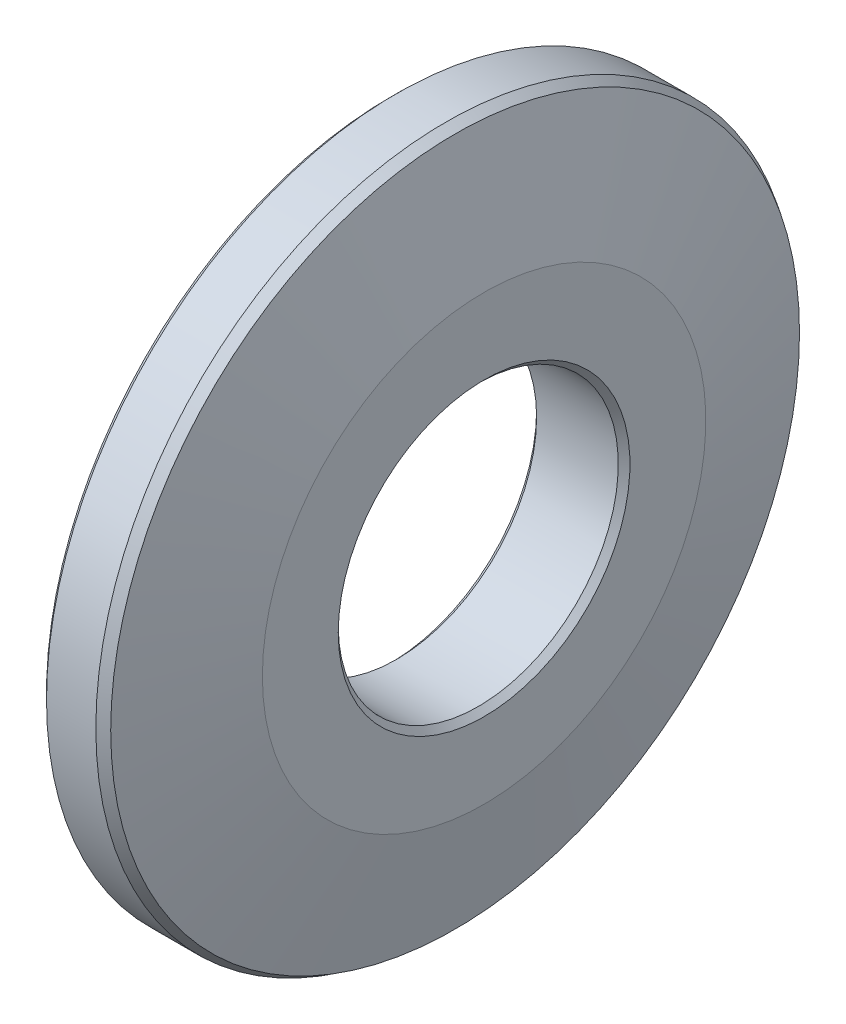
ISO-10303-21;
HEADER;
FILE_DESCRIPTION(('STEP AP214'),'2;1');
FILE_NAME('part.step','',(''),(''),'','','');
FILE_SCHEMA(('AUTOMOTIVE_DESIGN { 1 0 10303 214 1 1 1 1 }'));
ENDSEC;
DATA;
#1=APPLICATION_CONTEXT('core data for automotive mechanical design processes');
#2=APPLICATION_PROTOCOL_DEFINITION('international standard','automotive_design',2000,#1);
#3=PRODUCT_CONTEXT('',#1,'mechanical');
#4=PRODUCT('Part','Part','',(#3));
#5=PRODUCT_RELATED_PRODUCT_CATEGORY('part','',(#4));
#6=PRODUCT_DEFINITION_FORMATION('','',#4);
#7=PRODUCT_DEFINITION_CONTEXT('part definition',#1,'design');
#8=PRODUCT_DEFINITION('design','',#6,#7);
#9=PRODUCT_DEFINITION_SHAPE('','',#8);
#10=(LENGTH_UNIT() NAMED_UNIT(*) SI_UNIT(.MILLI.,.METRE.));
#11=(NAMED_UNIT(*) PLANE_ANGLE_UNIT() SI_UNIT($,.RADIAN.));
#12=(NAMED_UNIT(*) SI_UNIT($,.STERADIAN.) SOLID_ANGLE_UNIT());
#13=UNCERTAINTY_MEASURE_WITH_UNIT(LENGTH_MEASURE(1.E-05),#10,'distance_accuracy_value','');
#14=(GEOMETRIC_REPRESENTATION_CONTEXT(3) GLOBAL_UNCERTAINTY_ASSIGNED_CONTEXT((#13)) GLOBAL_UNIT_ASSIGNED_CONTEXT((#10,
#11,#12)) REPRESENTATION_CONTEXT('',''));
#15=CARTESIAN_POINT('',(0.,0.,0.));
#16=DIRECTION('',(0.,0.,1.));
#17=DIRECTION('',(1.,0.,0.));
#18=AXIS2_PLACEMENT_3D('',#15,#16,#17);
#19=CARTESIAN_POINT('',(0.,0.,-6.));
#20=DIRECTION('',(1.,0.,0.));
#21=DIRECTION('',(0.,0.,-1.));
#22=AXIS2_PLACEMENT_3D('',#19,#20,#21);
#23=PLANE('',#22);
#24=CARTESIAN_POINT('',(0.,0.,0.));
#25=DIRECTION('',(1.,0.,0.));
#26=DIRECTION('',(0.,0.,-1.));
#27=AXIS2_PLACEMENT_3D('',#24,#25,#26);
#28=CIRCLE('',#27,14.75);
#29=CARTESIAN_POINT('',(0.,0.,-14.75));
#30=VERTEX_POINT('',#29);
#31=EDGE_CURVE('E47',#30,#30,#28,.F.);
#32=ORIENTED_EDGE('',*,*,#31,.T.);
#33=EDGE_LOOP('',(#32));
#34=FACE_BOUND('',#33,.T.);
#35=CARTESIAN_POINT('',(0.,0.,0.));
#36=DIRECTION('',(1.,0.,0.));
#37=DIRECTION('',(0.,0.,-1.));
#38=AXIS2_PLACEMENT_3D('',#35,#36,#37);
#39=CIRCLE('',#38,6.25);
#40=CARTESIAN_POINT('',(0.,0.,-6.25));
#41=VERTEX_POINT('',#40);
#42=EDGE_CURVE('E52',#41,#41,#39,.T.);
#43=ORIENTED_EDGE('',*,*,#42,.T.);
#44=EDGE_LOOP('',(#43));
#45=FACE_BOUND('',#44,.T.);
#46=ADVANCED_FACE('F32',(#34,#45),#23,.F.);
#47=CARTESIAN_POINT('',(0.,0.,0.));
#48=DIRECTION('',(-1.,0.,0.));
#49=DIRECTION('',(0.,0.,1.));
#50=AXIS2_PLACEMENT_3D('',#47,#48,#49);
#51=CYLINDRICAL_SURFACE('',#50,15.);
#52=CARTESIAN_POINT('',(2.36359830592988,0.,0.));
#53=DIRECTION('',(-1.,0.,0.));
#54=DIRECTION('',(0.,0.,1.));
#55=AXIS2_PLACEMENT_3D('',#52,#53,#54);
#56=CIRCLE('',#55,15.);
#57=CARTESIAN_POINT('',(2.36359830592988,0.,15.));
#58=VERTEX_POINT('',#57);
#59=EDGE_CURVE('E58',#58,#58,#56,.T.);
#60=ORIENTED_EDGE('',*,*,#59,.T.);
#61=EDGE_LOOP('',(#60));
#62=FACE_BOUND('',#61,.T.);
#63=CARTESIAN_POINT('',(0.249999999999997,0.,0.));
#64=DIRECTION('',(1.,0.,0.));
#65=DIRECTION('',(0.,0.,-1.));
#66=AXIS2_PLACEMENT_3D('',#63,#64,#65);
#67=CIRCLE('',#66,15.);
#68=CARTESIAN_POINT('',(0.249999999999997,0.,-15.));
#69=VERTEX_POINT('',#68);
#70=EDGE_CURVE('E61',#69,#69,#67,.T.);
#71=ORIENTED_EDGE('',*,*,#70,.T.);
#72=EDGE_LOOP('',(#71));
#73=FACE_BOUND('',#72,.T.);
#74=ADVANCED_FACE('F80',(#62,#73),#51,.T.);
#75=CARTESIAN_POINT('',(4.,0.,0.));
#76=DIRECTION('',(-1.,0.,0.));
#77=DIRECTION('',(0.,0.,1.));
#78=AXIS2_PLACEMENT_3D('',#75,#76,#77);
#79=CONICAL_SURFACE('',#78,9.5,1.33869248871974);
#80=CARTESIAN_POINT('',(2.75750636348224,0.,0.));
#81=DIRECTION('',(1.,0.,0.));
#82=DIRECTION('',(0.,0.,-1.));
#83=AXIS2_PLACEMENT_3D('',#80,#81,#82);
#84=CIRCLE('',#83,14.7567038468059);
#85=CARTESIAN_POINT('',(2.75750636348224,0.,-14.7567038468059));
#86=VERTEX_POINT('',#85);
#87=EDGE_CURVE('E55',#86,#86,#84,.T.);
#88=ORIENTED_EDGE('',*,*,#87,.T.);
#89=EDGE_LOOP('',(#88));
#90=FACE_BOUND('',#89,.T.);
#91=CARTESIAN_POINT('',(4.,0.,0.));
#92=DIRECTION('',(-1.,0.,0.));
#93=DIRECTION('',(0.,0.,1.));
#94=AXIS2_PLACEMENT_3D('',#91,#92,#93);
#95=CIRCLE('',#94,9.5);
#96=CARTESIAN_POINT('',(4.,0.,9.5));
#97=VERTEX_POINT('',#96);
#98=EDGE_CURVE('E64',#97,#97,#95,.T.);
#99=ORIENTED_EDGE('',*,*,#98,.T.);
#100=EDGE_LOOP('',(#99));
#101=FACE_BOUND('',#100,.T.);
#102=ADVANCED_FACE('F68',(#90,#101),#79,.T.);
#103=CARTESIAN_POINT('',(4.,0.,-6.));
#104=DIRECTION('',(-1.,0.,0.));
#105=DIRECTION('',(0.,0.,1.));
#106=AXIS2_PLACEMENT_3D('',#103,#104,#105);
#107=PLANE('',#106);
#108=CARTESIAN_POINT('',(4.,0.,0.));
#109=DIRECTION('',(-1.,0.,0.));
#110=DIRECTION('',(0.,0.,1.));
#111=AXIS2_PLACEMENT_3D('',#108,#109,#110);
#112=CIRCLE('',#111,6.25);
#113=CARTESIAN_POINT('',(4.,0.,6.25));
#114=VERTEX_POINT('',#113);
#115=EDGE_CURVE('E10',#114,#114,#112,.T.);
#116=ORIENTED_EDGE('',*,*,#115,.T.);
#117=EDGE_LOOP('',(#116));
#118=FACE_BOUND('',#117,.T.);
#119=ORIENTED_EDGE('',*,*,#98,.F.);
#120=EDGE_LOOP('',(#119));
#121=FACE_BOUND('',#120,.T.);
#122=ADVANCED_FACE('F70',(#118,#121),#107,.F.);
#123=CARTESIAN_POINT('',(0.,0.,0.));
#124=DIRECTION('',(-1.,0.,0.));
#125=DIRECTION('',(0.,0.,1.));
#126=AXIS2_PLACEMENT_3D('',#123,#124,#125);
#127=CYLINDRICAL_SURFACE('',#126,6.);
#128=CARTESIAN_POINT('',(0.250000000000001,0.,0.));
#129=DIRECTION('',(1.,0.,0.));
#130=DIRECTION('',(0.,0.,-1.));
#131=AXIS2_PLACEMENT_3D('',#128,#129,#130);
#132=CIRCLE('',#131,6.);
#133=CARTESIAN_POINT('',(0.250000000000001,0.,-6.));
#134=VERTEX_POINT('',#133);
#135=EDGE_CURVE('E39',#134,#134,#132,.F.);
#136=ORIENTED_EDGE('',*,*,#135,.T.);
#137=EDGE_LOOP('',(#136));
#138=FACE_BOUND('',#137,.T.);
#139=CARTESIAN_POINT('',(3.75000000000001,0.,0.));
#140=DIRECTION('',(-1.,0.,0.));
#141=DIRECTION('',(0.,0.,1.));
#142=AXIS2_PLACEMENT_3D('',#139,#140,#141);
#143=CIRCLE('',#142,6.);
#144=CARTESIAN_POINT('',(3.75000000000001,0.,6.));
#145=VERTEX_POINT('',#144);
#146=EDGE_CURVE('E43',#145,#145,#143,.F.);
#147=ORIENTED_EDGE('',*,*,#146,.T.);
#148=EDGE_LOOP('',(#147));
#149=FACE_BOUND('',#148,.T.);
#150=ADVANCED_FACE('F72',(#138,#149),#127,.F.);
#151=CARTESIAN_POINT('',(2.36359830592988,0.,0.));
#152=DIRECTION('',(-1.,0.,0.));
#153=DIRECTION('',(0.,0.,1.));
#154=AXIS2_PLACEMENT_3D('',#151,#152,#153);
#155=CONICAL_SURFACE('',#154,15.,0.553294325322299);
#156=ORIENTED_EDGE('',*,*,#87,.F.);
#157=EDGE_LOOP('',(#156));
#158=FACE_BOUND('',#157,.T.);
#159=ORIENTED_EDGE('',*,*,#59,.F.);
#160=EDGE_LOOP('',(#159));
#161=FACE_BOUND('',#160,.T.);
#162=ADVANCED_FACE('F78',(#158,#161),#155,.T.);
#163=CARTESIAN_POINT('',(0.,0.,0.));
#164=DIRECTION('',(1.,0.,0.));
#165=DIRECTION('',(0.,0.,-1.));
#166=AXIS2_PLACEMENT_3D('',#163,#164,#165);
#167=CONICAL_SURFACE('',#166,14.75,0.785398163397448);
#168=ORIENTED_EDGE('',*,*,#70,.F.);
#169=EDGE_LOOP('',(#168));
#170=FACE_BOUND('',#169,.T.);
#171=ORIENTED_EDGE('',*,*,#31,.F.);
#172=EDGE_LOOP('',(#171));
#173=FACE_BOUND('',#172,.T.);
#174=ADVANCED_FACE('F95',(#170,#173),#167,.T.);
#175=CARTESIAN_POINT('',(0.250000000000001,0.,0.));
#176=DIRECTION('',(-1.,0.,0.));
#177=DIRECTION('',(0.,0.,1.));
#178=AXIS2_PLACEMENT_3D('',#175,#176,#177);
#179=CONICAL_SURFACE('',#178,6.,0.78539816339745);
#180=ORIENTED_EDGE('',*,*,#42,.F.);
#181=EDGE_LOOP('',(#180));
#182=FACE_BOUND('',#181,.T.);
#183=ORIENTED_EDGE('',*,*,#135,.F.);
#184=EDGE_LOOP('',(#183));
#185=FACE_BOUND('',#184,.T.);
#186=ADVANCED_FACE('F98',(#182,#185),#179,.F.);
#187=CARTESIAN_POINT('',(4.,0.,0.));
#188=DIRECTION('',(1.,0.,0.));
#189=DIRECTION('',(0.,0.,-1.));
#190=AXIS2_PLACEMENT_3D('',#187,#188,#189);
#191=CONICAL_SURFACE('',#190,6.25,0.785398163397455);
#192=ORIENTED_EDGE('',*,*,#146,.F.);
#193=EDGE_LOOP('',(#192));
#194=FACE_BOUND('',#193,.T.);
#195=ORIENTED_EDGE('',*,*,#115,.F.);
#196=EDGE_LOOP('',(#195));
#197=FACE_BOUND('',#196,.T.);
#198=ADVANCED_FACE('F34',(#194,#197),#191,.F.);
#199=CLOSED_SHELL('',(#46,#74,#102,#122,#150,#162,#174,#186,#198));
#200=MANIFOLD_SOLID_BREP('B2',#199);
#201=ADVANCED_BREP_SHAPE_REPRESENTATION('',(#18,#200),#14);
#202=SHAPE_DEFINITION_REPRESENTATION(#9,#201);
ENDSEC;
END-ISO-10303-21;
